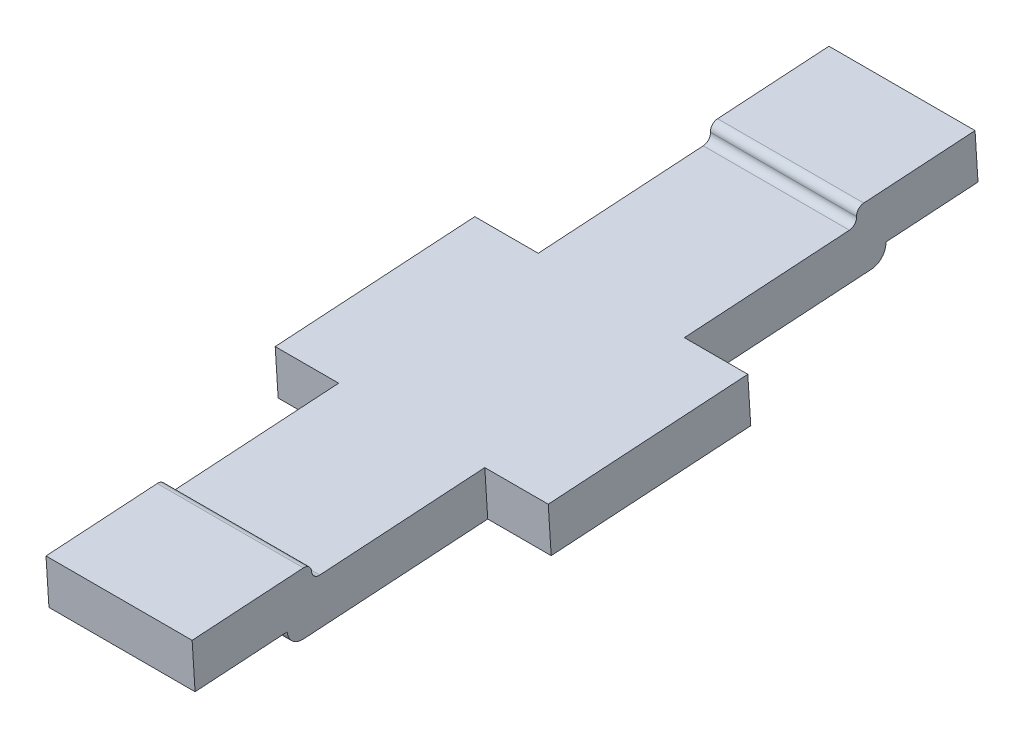
ISO-10303-21;
HEADER;
FILE_DESCRIPTION(('STEP AP214'),'2;1');
FILE_NAME('part.step','',(''),(''),'','','');
FILE_SCHEMA(('AUTOMOTIVE_DESIGN { 1 0 10303 214 1 1 1 1 }'));
ENDSEC;
DATA;
#1=APPLICATION_CONTEXT('core data for automotive mechanical design processes');
#2=APPLICATION_PROTOCOL_DEFINITION('international standard','automotive_design',2000,#1);
#3=PRODUCT_CONTEXT('',#1,'mechanical');
#4=PRODUCT('Part','Part','',(#3));
#5=PRODUCT_RELATED_PRODUCT_CATEGORY('part','',(#4));
#6=PRODUCT_DEFINITION_FORMATION('','',#4);
#7=PRODUCT_DEFINITION_CONTEXT('part definition',#1,'design');
#8=PRODUCT_DEFINITION('design','',#6,#7);
#9=PRODUCT_DEFINITION_SHAPE('','',#8);
#10=(LENGTH_UNIT() NAMED_UNIT(*) SI_UNIT(.MILLI.,.METRE.));
#11=(NAMED_UNIT(*) PLANE_ANGLE_UNIT() SI_UNIT($,.RADIAN.));
#12=(NAMED_UNIT(*) SI_UNIT($,.STERADIAN.) SOLID_ANGLE_UNIT());
#13=UNCERTAINTY_MEASURE_WITH_UNIT(LENGTH_MEASURE(1.E-05),#10,'distance_accuracy_value','');
#14=(GEOMETRIC_REPRESENTATION_CONTEXT(3) GLOBAL_UNCERTAINTY_ASSIGNED_CONTEXT((#13)) GLOBAL_UNIT_ASSIGNED_CONTEXT((#10,
#11,#12)) REPRESENTATION_CONTEXT('',''));
#15=CARTESIAN_POINT('',(0.,0.,0.));
#16=DIRECTION('',(0.,0.,1.));
#17=DIRECTION('',(1.,0.,0.));
#18=AXIS2_PLACEMENT_3D('',#15,#16,#17);
#19=CARTESIAN_POINT('',(-1.775,0.,0.));
#20=DIRECTION('',(1.,0.,0.));
#21=DIRECTION('',(0.,0.,-1.));
#22=AXIS2_PLACEMENT_3D('',#19,#20,#21);
#23=PLANE('',#22);
#24=DIRECTION('',(0.,0.997969082863627,0.0637001542253368));
#25=VECTOR('',#24,1.);
#26=CARTESIAN_POINT('',(-1.775,-0.707019964007326,1.25751663132818));
#27=LINE('',#26,#25);
#28=CARTESIAN_POINT('',(-1.775,-0.707019964007326,1.25751663132818));
#29=VERTEX_POINT('',#28);
#30=CARTESIAN_POINT('',(-1.775,-0.108238514289151,1.29573672386338));
#31=VERTEX_POINT('',#30);
#32=EDGE_CURVE('E11',#29,#31,#27,.T.);
#33=ORIENTED_EDGE('',*,*,#32,.T.);
#34=DIRECTION('',(0.,-0.0637001542253372,0.997969082863627));
#35=VECTOR('',#34,1.);
#36=CARTESIAN_POINT('',(-1.775,0.057381886696726,-1.29898289158205));
#37=LINE('',#36,#35);
#38=CARTESIAN_POINT('',(-1.775,0.057381886696726,-1.29898289158205));
#39=VERTEX_POINT('',#38);
#40=EDGE_CURVE('E42',#39,#31,#37,.T.);
#41=ORIENTED_EDGE('',*,*,#40,.F.);
#42=DIRECTION('',(0.,-0.997969082863627,-0.0637001542253365));
#43=VECTOR('',#42,1.);
#44=CARTESIAN_POINT('',(-1.775,0.057381886696726,-1.29898289158205));
#45=LINE('',#44,#43);
#46=CARTESIAN_POINT('',(-1.775,-0.54139956302145,-1.33720298411725));
#47=VERTEX_POINT('',#46);
#48=EDGE_CURVE('E28',#39,#47,#45,.T.);
#49=ORIENTED_EDGE('',*,*,#48,.T.);
#50=DIRECTION('',(0.,0.0637001542253371,-0.997969082863627));
#51=VECTOR('',#50,1.);
#52=CARTESIAN_POINT('',(-1.775,-0.707019964007326,1.25751663132818));
#53=LINE('',#52,#51);
#54=EDGE_CURVE('E262',#29,#47,#53,.T.);
#55=ORIENTED_EDGE('',*,*,#54,.F.);
#56=EDGE_LOOP('',(#33,#41,#49,#55));
#57=FACE_BOUND('',#56,.T.);
#58=ADVANCED_FACE('F17',(#57),#23,.F.);
#59=CARTESIAN_POINT('',(1.775,0.,0.));
#60=DIRECTION('',(1.,0.,0.));
#61=DIRECTION('',(0.,0.,-1.));
#62=AXIS2_PLACEMENT_3D('',#59,#60,#61);
#63=PLANE('',#62);
#64=DIRECTION('',(0.,-0.997969082863627,-0.0637001542253372));
#65=VECTOR('',#64,1.);
#66=CARTESIAN_POINT('',(1.775,-0.707019964007326,1.25751663132818));
#67=LINE('',#66,#65);
#68=CARTESIAN_POINT('',(1.775,-0.108238514289151,1.29573672386338));
#69=VERTEX_POINT('',#68);
#70=CARTESIAN_POINT('',(1.775,-0.707019964007326,1.25751663132818));
#71=VERTEX_POINT('',#70);
#72=EDGE_CURVE('E305',#69,#71,#67,.T.);
#73=ORIENTED_EDGE('',*,*,#72,.T.);
#74=DIRECTION('',(0.,0.0637001542253371,-0.997969082863627));
#75=VECTOR('',#74,1.);
#76=CARTESIAN_POINT('',(1.775,-0.707019964007326,1.25751663132818));
#77=LINE('',#76,#75);
#78=CARTESIAN_POINT('',(1.775,-0.54139956302145,-1.33720298411725));
#79=VERTEX_POINT('',#78);
#80=EDGE_CURVE('E309',#71,#79,#77,.T.);
#81=ORIENTED_EDGE('',*,*,#80,.T.);
#82=DIRECTION('',(0.,0.997969082863627,0.0637001542253368));
#83=VECTOR('',#82,1.);
#84=CARTESIAN_POINT('',(1.775,0.0573818866967259,-1.29898289158205));
#85=LINE('',#84,#83);
#86=CARTESIAN_POINT('',(1.775,0.0573818866967259,-1.29898289158205));
#87=VERTEX_POINT('',#86);
#88=EDGE_CURVE('E364',#79,#87,#85,.T.);
#89=ORIENTED_EDGE('',*,*,#88,.T.);
#90=DIRECTION('',(0.,-0.0637001542253372,0.997969082863627));
#91=VECTOR('',#90,1.);
#92=CARTESIAN_POINT('',(1.775,0.0573818866967259,-1.29898289158205));
#93=LINE('',#92,#91);
#94=EDGE_CURVE('E318',#87,#69,#93,.T.);
#95=ORIENTED_EDGE('',*,*,#94,.T.);
#96=EDGE_LOOP('',(#73,#81,#89,#95));
#97=FACE_BOUND('',#96,.T.);
#98=ADVANCED_FACE('F501',(#97),#63,.T.);
#99=CARTESIAN_POINT('',(-1.775,-0.749486733490884,5.06253917705503));
#100=DIRECTION('',(0.,-0.997969082863627,-0.0637001542253375));
#101=DIRECTION('',(0.,0.0637001542253375,-0.997969082863627));
#102=AXIS2_PLACEMENT_3D('',#99,#100,#101);
#103=PLANE('',#102);
#104=DIRECTION('',(0.,-0.0637001542253376,0.997969082863627));
#105=VECTOR('',#104,1.);
#106=CARTESIAN_POINT('',(0.95,-0.749486733490884,5.06253917705503));
#107=LINE('',#106,#105);
#108=CARTESIAN_POINT('',(0.95,-0.673046548420478,3.86497627761868));
#109=VERTEX_POINT('',#108);
#110=CARTESIAN_POINT('',(0.95,-0.749486733490884,5.06253917705503));
#111=VERTEX_POINT('',#110);
#112=EDGE_CURVE('E314',#109,#111,#107,.T.);
#113=ORIENTED_EDGE('',*,*,#112,.T.);
#114=DIRECTION('',(1.,0.,0.));
#115=VECTOR('',#114,1.);
#116=CARTESIAN_POINT('',(-0.95,-0.749486733490884,5.06253917705503));
#117=LINE('',#116,#115);
#118=CARTESIAN_POINT('',(-0.95,-0.749486733490884,5.06253917705503));
#119=VERTEX_POINT('',#118);
#120=EDGE_CURVE('E320',#119,#111,#117,.T.);
#121=ORIENTED_EDGE('',*,*,#120,.F.);
#122=DIRECTION('',(0.,0.0637001542253376,-0.997969082863627));
#123=VECTOR('',#122,1.);
#124=CARTESIAN_POINT('',(-0.95,-0.673046548420479,3.86497627761868));
#125=LINE('',#124,#123);
#126=CARTESIAN_POINT('',(-0.95,-0.673046548420478,3.86497627761868));
#127=VERTEX_POINT('',#126);
#128=EDGE_CURVE('E319',#119,#127,#125,.T.);
#129=ORIENTED_EDGE('',*,*,#128,.T.);
#130=DIRECTION('',(1.,0.,0.));
#131=VECTOR('',#130,1.);
#132=CARTESIAN_POINT('',(-0.95,-0.673046548420479,3.86497627761868));
#133=LINE('',#132,#131);
#134=EDGE_CURVE('E356',#127,#109,#133,.T.);
#135=ORIENTED_EDGE('',*,*,#134,.T.);
#136=EDGE_LOOP('',(#113,#121,#129,#135));
#137=FACE_BOUND('',#136,.T.);
#138=ADVANCED_FACE('F518',(#137),#103,.T.);
#139=CARTESIAN_POINT('',(-1.775,-0.150705283772707,5.10075926959023));
#140=DIRECTION('',(0.,-0.0637001542253374,0.997969082863627));
#141=DIRECTION('',(-1.,0.,0.));
#142=AXIS2_PLACEMENT_3D('',#139,#140,#141);
#143=PLANE('',#142);
#144=DIRECTION('',(0.,0.997969082863627,0.0637001542253374));
#145=VECTOR('',#144,1.);
#146=CARTESIAN_POINT('',(0.95,-0.150705283772707,5.10075926959023));
#147=LINE('',#146,#145);
#148=CARTESIAN_POINT('',(0.95,-0.150705283772707,5.10075926959023));
#149=VERTEX_POINT('',#148);
#150=EDGE_CURVE('E386',#111,#149,#147,.T.);
#151=ORIENTED_EDGE('',*,*,#150,.T.);
#152=DIRECTION('',(1.,0.,0.));
#153=VECTOR('',#152,1.);
#154=CARTESIAN_POINT('',(-0.95,-0.150705283772707,5.10075926959023));
#155=LINE('',#154,#153);
#156=CARTESIAN_POINT('',(-0.95,-0.150705283772707,5.10075926959023));
#157=VERTEX_POINT('',#156);
#158=EDGE_CURVE('E203',#157,#149,#155,.T.);
#159=ORIENTED_EDGE('',*,*,#158,.F.);
#160=DIRECTION('',(0.,-0.997969082863627,-0.0637001542253374));
#161=VECTOR('',#160,1.);
#162=CARTESIAN_POINT('',(-0.95,-0.749486733490884,5.06253917705503));
#163=LINE('',#162,#161);
#164=EDGE_CURVE('E323',#157,#119,#163,.T.);
#165=ORIENTED_EDGE('',*,*,#164,.T.);
#166=ORIENTED_EDGE('',*,*,#120,.T.);
#167=EDGE_LOOP('',(#151,#159,#165,#166));
#168=FACE_BOUND('',#167,.T.);
#169=ADVANCED_FACE('F516',(#168),#143,.T.);
#170=CARTESIAN_POINT('',(-1.775,-0.0583400601459682,3.65370409943797));
#171=DIRECTION('',(0.,0.997969082863627,0.0637001542253369));
#172=DIRECTION('',(1.,0.,0.));
#173=AXIS2_PLACEMENT_3D('',#170,#171,#172);
#174=PLANE('',#173);
#175=DIRECTION('',(0.,0.0637001542253369,-0.997969082863627));
#176=VECTOR('',#175,1.);
#177=CARTESIAN_POINT('',(0.95,-0.0583400601459682,3.65370409943797));
#178=LINE('',#177,#176);
#179=CARTESIAN_POINT('',(0.95,-0.0583400601459681,3.65370409943797));
#180=VERTEX_POINT('',#179);
#181=EDGE_CURVE('E324',#149,#180,#178,.T.);
#182=ORIENTED_EDGE('',*,*,#181,.T.);
#183=DIRECTION('',(1.,0.,0.));
#184=VECTOR('',#183,1.);
#185=CARTESIAN_POINT('',(-0.95,-0.0583400601459682,3.65370409943797));
#186=LINE('',#185,#184);
#187=CARTESIAN_POINT('',(-0.95,-0.0583400601459681,3.65370409943797));
#188=VERTEX_POINT('',#187);
#189=EDGE_CURVE('E219',#188,#180,#186,.T.);
#190=ORIENTED_EDGE('',*,*,#189,.F.);
#191=DIRECTION('',(0.,-0.0637001542253369,0.997969082863627));
#192=VECTOR('',#191,1.);
#193=CARTESIAN_POINT('',(-0.95,-0.150705283772707,5.10075926959023));
#194=LINE('',#193,#192);
#195=EDGE_CURVE('E337',#188,#157,#194,.T.);
#196=ORIENTED_EDGE('',*,*,#195,.T.);
#197=ORIENTED_EDGE('',*,*,#158,.T.);
#198=EDGE_LOOP('',(#182,#190,#196,#197));
#199=FACE_BOUND('',#198,.T.);
#200=ADVANCED_FACE('F521',(#199),#174,.T.);
#201=CARTESIAN_POINT('',(-1.775,-0.158136968432331,3.64733408401544));
#202=DIRECTION('',(1.,0.,0.));
#203=DIRECTION('',(0.,0.0637001542253356,-0.997969082863627));
#204=AXIS2_PLACEMENT_3D('',#201,#202,#203);
#205=CYLINDRICAL_SURFACE('',#204,0.1);
#206=CARTESIAN_POINT('',(0.95,-0.158136968432331,3.64733408401544));
#207=DIRECTION('',(-1.,0.,0.));
#208=DIRECTION('',(0.,0.0637001542253355,-0.997969082863627));
#209=AXIS2_PLACEMENT_3D('',#206,#207,#208);
#210=CIRCLE('',#209,0.1);
#211=CARTESIAN_POINT('',(0.95,-0.151766953009797,3.54753717572908));
#212=VERTEX_POINT('',#211);
#213=EDGE_CURVE('E338',#180,#212,#210,.T.);
#214=ORIENTED_EDGE('',*,*,#213,.T.);
#215=DIRECTION('',(1.,0.,0.));
#216=VECTOR('',#215,1.);
#217=CARTESIAN_POINT('',(-0.95,-0.151766953009797,3.54753717572908));
#218=LINE('',#217,#216);
#219=CARTESIAN_POINT('',(-0.95,-0.151766953009797,3.54753717572908));
#220=VERTEX_POINT('',#219);
#221=EDGE_CURVE('E399',#220,#212,#218,.T.);
#222=ORIENTED_EDGE('',*,*,#221,.F.);
#223=CARTESIAN_POINT('',(-0.95,-0.158136968432331,3.64733408401544));
#224=DIRECTION('',(1.,0.,0.));
#225=DIRECTION('',(0.,0.0637001542253355,-0.997969082863627));
#226=AXIS2_PLACEMENT_3D('',#223,#224,#225);
#227=CIRCLE('',#226,0.1);
#228=EDGE_CURVE('E390',#220,#188,#227,.T.);
#229=ORIENTED_EDGE('',*,*,#228,.T.);
#230=ORIENTED_EDGE('',*,*,#189,.T.);
#231=EDGE_LOOP('',(#214,#222,#229,#230));
#232=FACE_BOUND('',#231,.T.);
#233=ADVANCED_FACE('F523',(#232),#205,.T.);
#234=CARTESIAN_POINT('',(-1.775,-0.145396937587263,3.44774026744271));
#235=DIRECTION('',(-1.,0.,0.));
#236=DIRECTION('',(0.,-0.997969082863627,-0.0637001542253391));
#237=AXIS2_PLACEMENT_3D('',#234,#235,#236);
#238=CYLINDRICAL_SURFACE('',#237,0.1);
#239=CARTESIAN_POINT('',(0.95,-0.145396937587263,3.44774026744271));
#240=DIRECTION('',(1.,0.,0.));
#241=DIRECTION('',(0.,-0.997969082863627,-0.063700154225339));
#242=AXIS2_PLACEMENT_3D('',#239,#240,#241);
#243=CIRCLE('',#242,0.1);
#244=CARTESIAN_POINT('',(0.95,-0.245193845873626,3.44137025202018));
#245=VERTEX_POINT('',#244);
#246=EDGE_CURVE('E300',#212,#245,#243,.T.);
#247=ORIENTED_EDGE('',*,*,#246,.T.);
#248=DIRECTION('',(1.,0.,0.));
#249=VECTOR('',#248,1.);
#250=CARTESIAN_POINT('',(-0.95,-0.245193845873626,3.44137025202018));
#251=LINE('',#250,#249);
#252=CARTESIAN_POINT('',(-0.95,-0.245193845873626,3.44137025202018));
#253=VERTEX_POINT('',#252);
#254=EDGE_CURVE('E325',#253,#245,#251,.T.);
#255=ORIENTED_EDGE('',*,*,#254,.F.);
#256=CARTESIAN_POINT('',(-0.95,-0.145396937587263,3.44774026744271));
#257=DIRECTION('',(-1.,0.,0.));
#258=DIRECTION('',(0.,-0.997969082863627,-0.063700154225339));
#259=AXIS2_PLACEMENT_3D('',#256,#257,#258);
#260=CIRCLE('',#259,0.1);
#261=EDGE_CURVE('E402',#253,#220,#260,.T.);
#262=ORIENTED_EDGE('',*,*,#261,.T.);
#263=ORIENTED_EDGE('',*,*,#221,.T.);
#264=EDGE_LOOP('',(#247,#255,#262,#263));
#265=FACE_BOUND('',#264,.T.);
#266=ADVANCED_FACE('F526',(#265),#238,.F.);
#267=CARTESIAN_POINT('',(-1.775,0.194337218281201,-3.44461641973884));
#268=DIRECTION('',(0.,0.997969082863627,0.0637001542253372));
#269=DIRECTION('',(1.,0.,0.));
#270=AXIS2_PLACEMENT_3D('',#267,#268,#269);
#271=PLANE('',#270);
#272=DIRECTION('',(1.,0.,0.));
#273=VECTOR('',#272,1.);
#274=CARTESIAN_POINT('',(1.775,-0.108238514289151,1.29573672386338));
#275=LINE('',#274,#273);
#276=CARTESIAN_POINT('',(0.95,-0.108238514289151,1.29573672386338));
#277=VERTEX_POINT('',#276);
#278=EDGE_CURVE('E379',#277,#69,#275,.T.);
#279=ORIENTED_EDGE('',*,*,#278,.T.);
#280=ORIENTED_EDGE('',*,*,#94,.F.);
#281=DIRECTION('',(-1.,0.,0.));
#282=VECTOR('',#281,1.);
#283=CARTESIAN_POINT('',(0.95,0.0573818866967259,-1.29898289158205));
#284=LINE('',#283,#282);
#285=CARTESIAN_POINT('',(0.95,0.0573818866967253,-1.29898289158205));
#286=VERTEX_POINT('',#285);
#287=EDGE_CURVE('E370',#87,#286,#284,.T.);
#288=ORIENTED_EDGE('',*,*,#287,.T.);
#289=DIRECTION('',(0.,0.0637001542253372,-0.997969082863627));
#290=VECTOR('',#289,1.);
#291=CARTESIAN_POINT('',(0.95,0.194337218281201,-3.44461641973884));
#292=LINE('',#291,#290);
#293=CARTESIAN_POINT('',(0.95,0.194337218281201,-3.44461641973884));
#294=VERTEX_POINT('',#293);
#295=EDGE_CURVE('E59',#286,#294,#292,.T.);
#296=ORIENTED_EDGE('',*,*,#295,.T.);
#297=DIRECTION('',(1.,0.,0.));
#298=VECTOR('',#297,1.);
#299=CARTESIAN_POINT('',(-0.95,0.194337218281201,-3.44461641973884));
#300=LINE('',#299,#298);
#301=CARTESIAN_POINT('',(-0.95,0.194337218281201,-3.44461641973884));
#302=VERTEX_POINT('',#301);
#303=EDGE_CURVE('E75',#302,#294,#300,.T.);
#304=ORIENTED_EDGE('',*,*,#303,.F.);
#305=DIRECTION('',(0.,-0.0637001542253372,0.997969082863627));
#306=VECTOR('',#305,1.);
#307=CARTESIAN_POINT('',(-0.95,0.0573818866967259,-1.29898289158205));
#308=LINE('',#307,#306);
#309=CARTESIAN_POINT('',(-0.95,0.0573818866967262,-1.29898289158205));
#310=VERTEX_POINT('',#309);
#311=EDGE_CURVE('E371',#302,#310,#308,.T.);
#312=ORIENTED_EDGE('',*,*,#311,.T.);
#313=DIRECTION('',(-1.,0.,0.));
#314=VECTOR('',#313,1.);
#315=CARTESIAN_POINT('',(-1.775,0.057381886696726,-1.29898289158205));
#316=LINE('',#315,#314);
#317=EDGE_CURVE('E395',#310,#39,#316,.T.);
#318=ORIENTED_EDGE('',*,*,#317,.T.);
#319=ORIENTED_EDGE('',*,*,#40,.T.);
#320=DIRECTION('',(1.,0.,0.));
#321=VECTOR('',#320,1.);
#322=CARTESIAN_POINT('',(-0.95,-0.108238514289151,1.29573672386338));
#323=LINE('',#322,#321);
#324=CARTESIAN_POINT('',(-0.95,-0.108238514289151,1.29573672386338));
#325=VERTEX_POINT('',#324);
#326=EDGE_CURVE('E343',#31,#325,#323,.T.);
#327=ORIENTED_EDGE('',*,*,#326,.T.);
#328=DIRECTION('',(0.,-0.0637001542253371,0.997969082863627));
#329=VECTOR('',#328,1.);
#330=CARTESIAN_POINT('',(-0.95,-0.245193845873626,3.44137025202018));
#331=LINE('',#330,#329);
#332=EDGE_CURVE('E278',#325,#253,#331,.T.);
#333=ORIENTED_EDGE('',*,*,#332,.T.);
#334=ORIENTED_EDGE('',*,*,#254,.T.);
#335=DIRECTION('',(0.,0.0637001542253371,-0.997969082863627));
#336=VECTOR('',#335,1.);
#337=CARTESIAN_POINT('',(0.95,-0.108238514289151,1.29573672386338));
#338=LINE('',#337,#336);
#339=EDGE_CURVE('E328',#245,#277,#338,.T.);
#340=ORIENTED_EDGE('',*,*,#339,.T.);
#341=EDGE_LOOP('',(#279,#280,#288,#296,#304,#312,#318,#319,#327,#333,#334,#340));
#342=FACE_BOUND('',#341,.T.);
#343=ADVANCED_FACE('F527',(#342),#271,.T.);
#344=CARTESIAN_POINT('',(-1.775,0.294134126567563,-3.43824640431631));
#345=DIRECTION('',(-1.,0.,0.));
#346=DIRECTION('',(0.,0.0637001542253392,-0.997969082863627));
#347=AXIS2_PLACEMENT_3D('',#344,#345,#346);
#348=CYLINDRICAL_SURFACE('',#347,0.1);
#349=CARTESIAN_POINT('',(0.95,0.294134126567564,-3.43824640431631));
#350=DIRECTION('',(1.,0.,0.));
#351=DIRECTION('',(0.,0.0637001542253391,-0.997969082863627));
#352=AXIS2_PLACEMENT_3D('',#349,#350,#351);
#353=CIRCLE('',#352,0.1);
#354=CARTESIAN_POINT('',(0.95,0.300504141990097,-3.53804331260267));
#355=VERTEX_POINT('',#354);
#356=EDGE_CURVE('E313',#294,#355,#353,.T.);
#357=ORIENTED_EDGE('',*,*,#356,.T.);
#358=DIRECTION('',(1.,0.,0.));
#359=VECTOR('',#358,1.);
#360=CARTESIAN_POINT('',(-0.95,0.300504141990097,-3.53804331260267));
#361=LINE('',#360,#359);
#362=CARTESIAN_POINT('',(-0.95,0.300504141990097,-3.53804331260267));
#363=VERTEX_POINT('',#362);
#364=EDGE_CURVE('E301',#363,#355,#361,.T.);
#365=ORIENTED_EDGE('',*,*,#364,.F.);
#366=CARTESIAN_POINT('',(-0.95,0.294134126567564,-3.43824640431631));
#367=DIRECTION('',(-1.,0.,0.));
#368=DIRECTION('',(0.,0.0637001542253391,-0.997969082863627));
#369=AXIS2_PLACEMENT_3D('',#366,#367,#368);
#370=CIRCLE('',#369,0.1);
#371=EDGE_CURVE('E310',#363,#302,#370,.T.);
#372=ORIENTED_EDGE('',*,*,#371,.T.);
#373=ORIENTED_EDGE('',*,*,#303,.T.);
#374=EDGE_LOOP('',(#357,#365,#372,#373));
#375=FACE_BOUND('',#374,.T.);
#376=ADVANCED_FACE('F535',(#375),#348,.F.);
#377=CARTESIAN_POINT('',(-1.775,0.306874157412631,-3.63784022088904));
#378=DIRECTION('',(1.,0.,0.));
#379=DIRECTION('',(0.,0.997969082863627,0.0637001542253391));
#380=AXIS2_PLACEMENT_3D('',#377,#378,#379);
#381=CYLINDRICAL_SURFACE('',#380,0.1);
#382=CARTESIAN_POINT('',(0.95,0.306874157412631,-3.63784022088904));
#383=DIRECTION('',(-1.,0.,0.));
#384=DIRECTION('',(0.,0.997969082863627,0.063700154225339));
#385=AXIS2_PLACEMENT_3D('',#382,#383,#384);
#386=CIRCLE('',#385,0.1);
#387=CARTESIAN_POINT('',(0.95,0.406671065698993,-3.6314702054665));
#388=VERTEX_POINT('',#387);
#389=EDGE_CURVE('E376',#355,#388,#386,.T.);
#390=ORIENTED_EDGE('',*,*,#389,.T.);
#391=DIRECTION('',(1.,0.,0.));
#392=VECTOR('',#391,1.);
#393=CARTESIAN_POINT('',(-0.95,0.406671065698993,-3.6314702054665));
#394=LINE('',#393,#392);
#395=CARTESIAN_POINT('',(-0.95,0.406671065698993,-3.6314702054665));
#396=VERTEX_POINT('',#395);
#397=EDGE_CURVE('E431',#396,#388,#394,.T.);
#398=ORIENTED_EDGE('',*,*,#397,.F.);
#399=CARTESIAN_POINT('',(-0.95,0.306874157412631,-3.63784022088904));
#400=DIRECTION('',(1.,0.,0.));
#401=DIRECTION('',(0.,0.997969082863627,0.063700154225339));
#402=AXIS2_PLACEMENT_3D('',#399,#400,#401);
#403=CIRCLE('',#402,0.1);
#404=EDGE_CURVE('E303',#396,#363,#403,.T.);
#405=ORIENTED_EDGE('',*,*,#404,.T.);
#406=ORIENTED_EDGE('',*,*,#364,.T.);
#407=EDGE_LOOP('',(#390,#398,#405,#406));
#408=FACE_BOUND('',#407,.T.);
#409=ADVANCED_FACE('F537',(#408),#381,.T.);
#410=CARTESIAN_POINT('',(-1.775,0.499036289325733,-5.07852537561876));
#411=DIRECTION('',(0.,0.997969082863627,0.0637001542253375));
#412=DIRECTION('',(1.,0.,0.));
#413=AXIS2_PLACEMENT_3D('',#410,#411,#412);
#414=PLANE('',#413);
#415=DIRECTION('',(0.,0.0637001542253375,-0.997969082863627));
#416=VECTOR('',#415,1.);
#417=CARTESIAN_POINT('',(0.95,0.499036289325733,-5.07852537561876));
#418=LINE('',#417,#416);
#419=CARTESIAN_POINT('',(0.95,0.499036289325733,-5.07852537561876));
#420=VERTEX_POINT('',#419);
#421=EDGE_CURVE('E304',#388,#420,#418,.T.);
#422=ORIENTED_EDGE('',*,*,#421,.T.);
#423=DIRECTION('',(1.,0.,0.));
#424=VECTOR('',#423,1.);
#425=CARTESIAN_POINT('',(-0.95,0.499036289325733,-5.07852537561876));
#426=LINE('',#425,#424);
#427=CARTESIAN_POINT('',(-0.95,0.499036289325733,-5.07852537561876));
#428=VERTEX_POINT('',#427);
#429=EDGE_CURVE('E334',#428,#420,#426,.T.);
#430=ORIENTED_EDGE('',*,*,#429,.F.);
#431=DIRECTION('',(0.,-0.0637001542253375,0.997969082863627));
#432=VECTOR('',#431,1.);
#433=CARTESIAN_POINT('',(-0.95,0.406671065698993,-3.6314702054665));
#434=LINE('',#433,#432);
#435=EDGE_CURVE('E419',#428,#396,#434,.T.);
#436=ORIENTED_EDGE('',*,*,#435,.T.);
#437=ORIENTED_EDGE('',*,*,#397,.T.);
#438=EDGE_LOOP('',(#422,#430,#436,#437));
#439=FACE_BOUND('',#438,.T.);
#440=ADVANCED_FACE('F483',(#439),#414,.T.);
#441=CARTESIAN_POINT('',(-1.775,-0.099745160392445,-5.11674546815396));
#442=DIRECTION('',(0.,0.0637001542253403,-0.997969082863627));
#443=DIRECTION('',(-1.,0.,0.));
#444=AXIS2_PLACEMENT_3D('',#441,#442,#443);
#445=PLANE('',#444);
#446=DIRECTION('',(0.,-0.997969082863627,-0.0637001542253406));
#447=VECTOR('',#446,1.);
#448=CARTESIAN_POINT('',(0.95,-0.099745160392445,-5.11674546815396));
#449=LINE('',#448,#447);
#450=CARTESIAN_POINT('',(0.95,-0.099745160392445,-5.11674546815397));
#451=VERTEX_POINT('',#450);
#452=EDGE_CURVE('E333',#420,#451,#449,.T.);
#453=ORIENTED_EDGE('',*,*,#452,.T.);
#454=DIRECTION('',(1.,0.,0.));
#455=VECTOR('',#454,1.);
#456=CARTESIAN_POINT('',(-0.95,-0.099745160392445,-5.11674546815396));
#457=LINE('',#456,#455);
#458=CARTESIAN_POINT('',(-0.95,-0.099745160392445,-5.11674546815396));
#459=VERTEX_POINT('',#458);
#460=EDGE_CURVE('E398',#459,#451,#457,.T.);
#461=ORIENTED_EDGE('',*,*,#460,.F.);
#462=DIRECTION('',(0.,0.997969082863627,0.0637001542253407));
#463=VECTOR('',#462,1.);
#464=CARTESIAN_POINT('',(-0.95,0.499036289325729,-5.07852537561876));
#465=LINE('',#464,#463);
#466=EDGE_CURVE('E329',#459,#428,#465,.T.);
#467=ORIENTED_EDGE('',*,*,#466,.T.);
#468=ORIENTED_EDGE('',*,*,#429,.T.);
#469=EDGE_LOOP('',(#453,#461,#467,#468));
#470=FACE_BOUND('',#469,.T.);
#471=ADVANCED_FACE('F19',(#470),#445,.T.);
#472=CARTESIAN_POINT('',(-1.775,-0.176185345462849,-3.91918256871761));
#473=DIRECTION('',(0.,-0.997969082863627,-0.063700154225337));
#474=DIRECTION('',(0.,0.063700154225337,-0.997969082863627));
#475=AXIS2_PLACEMENT_3D('',#472,#473,#474);
#476=PLANE('',#475);
#477=DIRECTION('',(0.,-0.0637001542253369,0.997969082863627));
#478=VECTOR('',#477,1.);
#479=CARTESIAN_POINT('',(0.95,-0.176185345462849,-3.91918256871761));
#480=LINE('',#479,#478);
#481=CARTESIAN_POINT('',(0.95,-0.176185345462849,-3.91918256871761));
#482=VERTEX_POINT('',#481);
#483=EDGE_CURVE('E441',#451,#482,#480,.T.);
#484=ORIENTED_EDGE('',*,*,#483,.T.);
#485=DIRECTION('',(1.,0.,0.));
#486=VECTOR('',#485,1.);
#487=CARTESIAN_POINT('',(-0.95,-0.176185345462849,-3.91918256871761));
#488=LINE('',#487,#486);
#489=CARTESIAN_POINT('',(-0.95,-0.176185345462849,-3.91918256871761));
#490=VERTEX_POINT('',#489);
#491=EDGE_CURVE('E90',#490,#482,#488,.T.);
#492=ORIENTED_EDGE('',*,*,#491,.F.);
#493=DIRECTION('',(0.,0.063700154225337,-0.997969082863627));
#494=VECTOR('',#493,1.);
#495=CARTESIAN_POINT('',(-0.95,-0.099745160392445,-5.11674546815396));
#496=LINE('',#495,#494);
#497=EDGE_CURVE('E410',#490,#459,#496,.T.);
#498=ORIENTED_EDGE('',*,*,#497,.T.);
#499=ORIENTED_EDGE('',*,*,#460,.T.);
#500=EDGE_LOOP('',(#484,#492,#498,#499));
#501=FACE_BOUND('',#500,.T.);
#502=ADVANCED_FACE('F492',(#501),#476,.T.);
#503=CARTESIAN_POINT('',(-1.775,-0.188925376307915,-3.71958875214489));
#504=DIRECTION('',(1.,0.,0.));
#505=DIRECTION('',(0.,-0.997969082863627,-0.0637001542253369));
#506=AXIS2_PLACEMENT_3D('',#503,#504,#505);
#507=CYLINDRICAL_SURFACE('',#506,0.2);
#508=CARTESIAN_POINT('',(0.95,-0.188925376307915,-3.71958875214489));
#509=DIRECTION('',(-1.,0.,0.));
#510=DIRECTION('',(0.,-0.997969082863627,-0.0637001542253368));
#511=AXIS2_PLACEMENT_3D('',#508,#509,#510);
#512=CIRCLE('',#511,0.2);
#513=CARTESIAN_POINT('',(0.95,-0.388519192880641,-3.73232878298995));
#514=VERTEX_POINT('',#513);
#515=EDGE_CURVE('E352',#482,#514,#512,.T.);
#516=ORIENTED_EDGE('',*,*,#515,.T.);
#517=DIRECTION('',(1.,0.,0.));
#518=VECTOR('',#517,1.);
#519=CARTESIAN_POINT('',(-0.95,-0.388519192880641,-3.73232878298995));
#520=LINE('',#519,#518);
#521=CARTESIAN_POINT('',(-0.95,-0.388519192880641,-3.73232878298995));
#522=VERTEX_POINT('',#521);
#523=EDGE_CURVE('E102',#522,#514,#520,.T.);
#524=ORIENTED_EDGE('',*,*,#523,.F.);
#525=CARTESIAN_POINT('',(-0.95,-0.188925376307915,-3.71958875214489));
#526=DIRECTION('',(1.,0.,0.));
#527=DIRECTION('',(0.,-0.997969082863627,-0.0637001542253368));
#528=AXIS2_PLACEMENT_3D('',#525,#526,#527);
#529=CIRCLE('',#528,0.2);
#530=EDGE_CURVE('E348',#522,#490,#529,.T.);
#531=ORIENTED_EDGE('',*,*,#530,.T.);
#532=ORIENTED_EDGE('',*,*,#491,.T.);
#533=EDGE_LOOP('',(#516,#524,#531,#532));
#534=FACE_BOUND('',#533,.T.);
#535=ADVANCED_FACE('F494',(#534),#507,.T.);
#536=CARTESIAN_POINT('',(-1.775,-0.859900334148136,3.65264243020089));
#537=DIRECTION('',(0.,-0.997969082863627,-0.0637001542253371));
#538=DIRECTION('',(0.,0.0637001542253371,-0.997969082863627));
#539=AXIS2_PLACEMENT_3D('',#536,#537,#538);
#540=PLANE('',#539);
#541=DIRECTION('',(-1.,0.,0.));
#542=VECTOR('',#541,1.);
#543=CARTESIAN_POINT('',(0.95,-0.707019964007326,1.25751663132818));
#544=LINE('',#543,#542);
#545=CARTESIAN_POINT('',(0.95,-0.707019964007326,1.25751663132818));
#546=VERTEX_POINT('',#545);
#547=EDGE_CURVE('E349',#71,#546,#544,.T.);
#548=ORIENTED_EDGE('',*,*,#547,.T.);
#549=DIRECTION('',(0.,-0.0637001542253372,0.997969082863627));
#550=VECTOR('',#549,1.);
#551=CARTESIAN_POINT('',(0.95,-0.859900334148136,3.65264243020089));
#552=LINE('',#551,#550);
#553=CARTESIAN_POINT('',(0.95,-0.859900334148136,3.65264243020089));
#554=VERTEX_POINT('',#553);
#555=EDGE_CURVE('E273',#546,#554,#552,.T.);
#556=ORIENTED_EDGE('',*,*,#555,.T.);
#557=DIRECTION('',(1.,0.,0.));
#558=VECTOR('',#557,1.);
#559=CARTESIAN_POINT('',(-0.95,-0.859900334148136,3.65264243020089));
#560=LINE('',#559,#558);
#561=CARTESIAN_POINT('',(-0.95,-0.859900334148136,3.65264243020089));
#562=VERTEX_POINT('',#561);
#563=EDGE_CURVE('E268',#562,#554,#560,.T.);
#564=ORIENTED_EDGE('',*,*,#563,.F.);
#565=DIRECTION('',(0.,0.0637001542253371,-0.997969082863627));
#566=VECTOR('',#565,1.);
#567=CARTESIAN_POINT('',(-0.95,-0.707019964007326,1.25751663132818));
#568=LINE('',#567,#566);
#569=CARTESIAN_POINT('',(-0.95,-0.707019964007327,1.25751663132818));
#570=VERTEX_POINT('',#569);
#571=EDGE_CURVE('E261',#562,#570,#568,.T.);
#572=ORIENTED_EDGE('',*,*,#571,.T.);
#573=DIRECTION('',(-1.,0.,0.));
#574=VECTOR('',#573,1.);
#575=CARTESIAN_POINT('',(-1.775,-0.707019964007326,1.25751663132818));
#576=LINE('',#575,#574);
#577=EDGE_CURVE('E255',#570,#29,#576,.T.);
#578=ORIENTED_EDGE('',*,*,#577,.T.);
#579=ORIENTED_EDGE('',*,*,#54,.T.);
#580=DIRECTION('',(1.,0.,0.));
#581=VECTOR('',#580,1.);
#582=CARTESIAN_POINT('',(-0.95,-0.54139956302145,-1.33720298411725));
#583=LINE('',#582,#581);
#584=CARTESIAN_POINT('',(-0.95,-0.54139956302145,-1.33720298411725));
#585=VERTEX_POINT('',#584);
#586=EDGE_CURVE('E361',#47,#585,#583,.T.);
#587=ORIENTED_EDGE('',*,*,#586,.T.);
#588=DIRECTION('',(0.,0.0637001542253372,-0.997969082863627));
#589=VECTOR('',#588,1.);
#590=CARTESIAN_POINT('',(-0.95,-0.388519192880641,-3.73232878298995));
#591=LINE('',#590,#589);
#592=EDGE_CURVE('E341',#585,#522,#591,.T.);
#593=ORIENTED_EDGE('',*,*,#592,.T.);
#594=ORIENTED_EDGE('',*,*,#523,.T.);
#595=DIRECTION('',(0.,-0.0637001542253371,0.997969082863627));
#596=VECTOR('',#595,1.);
#597=CARTESIAN_POINT('',(0.95,-0.54139956302145,-1.33720298411725));
#598=LINE('',#597,#596);
#599=CARTESIAN_POINT('',(0.95,-0.54139956302145,-1.33720298411725));
#600=VERTEX_POINT('',#599);
#601=EDGE_CURVE('E342',#514,#600,#598,.T.);
#602=ORIENTED_EDGE('',*,*,#601,.T.);
#603=DIRECTION('',(1.,0.,0.));
#604=VECTOR('',#603,1.);
#605=CARTESIAN_POINT('',(1.775,-0.54139956302145,-1.33720298411725));
#606=LINE('',#605,#604);
#607=EDGE_CURVE('E413',#600,#79,#606,.T.);
#608=ORIENTED_EDGE('',*,*,#607,.T.);
#609=ORIENTED_EDGE('',*,*,#80,.F.);
#610=EDGE_LOOP('',(#548,#556,#564,#572,#578,#579,#587,#593,#594,#602,#608,#609));
#611=FACE_BOUND('',#610,.T.);
#612=ADVANCED_FACE('F266',(#611),#540,.T.);
#613=CARTESIAN_POINT('',(-1.775,-0.66030651757541,3.66538246104595));
#614=DIRECTION('',(1.,0.,0.));
#615=DIRECTION('',(0.,-0.0637001542253351,0.997969082863627));
#616=AXIS2_PLACEMENT_3D('',#613,#614,#615);
#617=CYLINDRICAL_SURFACE('',#616,0.2);
#618=CARTESIAN_POINT('',(0.95,-0.66030651757541,3.66538246104595));
#619=DIRECTION('',(-1.,0.,0.));
#620=DIRECTION('',(0.,-0.0637001542253352,0.997969082863627));
#621=AXIS2_PLACEMENT_3D('',#618,#619,#620);
#622=CIRCLE('',#621,0.2);
#623=EDGE_CURVE('E420',#554,#109,#622,.T.);
#624=ORIENTED_EDGE('',*,*,#623,.T.);
#625=ORIENTED_EDGE('',*,*,#134,.F.);
#626=CARTESIAN_POINT('',(-0.95,-0.66030651757541,3.66538246104595));
#627=DIRECTION('',(1.,0.,0.));
#628=DIRECTION('',(0.,-0.0637001542253351,0.997969082863627));
#629=AXIS2_PLACEMENT_3D('',#626,#627,#628);
#630=CIRCLE('',#629,0.2);
#631=EDGE_CURVE('E424',#127,#562,#630,.T.);
#632=ORIENTED_EDGE('',*,*,#631,.T.);
#633=ORIENTED_EDGE('',*,*,#563,.T.);
#634=EDGE_LOOP('',(#624,#625,#632,#633));
#635=FACE_BOUND('',#634,.T.);
#636=ADVANCED_FACE('F512',(#635),#617,.T.);
#637=CARTESIAN_POINT('',(-0.95,-2.09725004933813,-1.43651258962682));
#638=DIRECTION('',(1.,0.,0.));
#639=DIRECTION('',(0.,0.,1.));
#640=AXIS2_PLACEMENT_3D('',#637,#638,#639);
#641=PLANE('',#640);
#642=ORIENTED_EDGE('',*,*,#592,.F.);
#643=DIRECTION('',(0.,0.997969082863627,0.0637001542253371));
#644=VECTOR('',#643,1.);
#645=CARTESIAN_POINT('',(-0.95,-0.54139956302145,-1.33720298411725));
#646=LINE('',#645,#644);
#647=EDGE_CURVE('E287',#585,#310,#646,.T.);
#648=ORIENTED_EDGE('',*,*,#647,.T.);
#649=ORIENTED_EDGE('',*,*,#311,.F.);
#650=ORIENTED_EDGE('',*,*,#371,.F.);
#651=ORIENTED_EDGE('',*,*,#404,.F.);
#652=ORIENTED_EDGE('',*,*,#435,.F.);
#653=ORIENTED_EDGE('',*,*,#466,.F.);
#654=ORIENTED_EDGE('',*,*,#497,.F.);
#655=ORIENTED_EDGE('',*,*,#530,.F.);
#656=EDGE_LOOP('',(#642,#648,#649,#650,#651,#652,#653,#654,#655));
#657=FACE_BOUND('',#656,.T.);
#658=ADVANCED_FACE('F487',(#657),#641,.F.);
#659=CARTESIAN_POINT('',(-1.775,-2.09725004933813,-1.43651258962682));
#660=DIRECTION('',(0.,-0.0637001542253368,0.997969082863627));
#661=DIRECTION('',(-1.,0.,0.));
#662=AXIS2_PLACEMENT_3D('',#659,#660,#661);
#663=PLANE('',#662);
#664=ORIENTED_EDGE('',*,*,#586,.F.);
#665=ORIENTED_EDGE('',*,*,#48,.F.);
#666=ORIENTED_EDGE('',*,*,#317,.F.);
#667=ORIENTED_EDGE('',*,*,#647,.F.);
#668=EDGE_LOOP('',(#664,#665,#666,#667));
#669=FACE_BOUND('',#668,.T.);
#670=ADVANCED_FACE('F571',(#669),#663,.F.);
#671=CARTESIAN_POINT('',(0.95,-2.09725004933813,-1.43651258962682));
#672=DIRECTION('',(0.,-0.063700154225337,0.997969082863627));
#673=DIRECTION('',(-1.,0.,0.));
#674=AXIS2_PLACEMENT_3D('',#671,#672,#673);
#675=PLANE('',#674);
#676=ORIENTED_EDGE('',*,*,#607,.F.);
#677=DIRECTION('',(0.,0.997969082863627,0.0637001542253369));
#678=VECTOR('',#677,1.);
#679=CARTESIAN_POINT('',(0.95,-0.54139956302145,-1.33720298411725));
#680=LINE('',#679,#678);
#681=EDGE_CURVE('E280',#600,#286,#680,.T.);
#682=ORIENTED_EDGE('',*,*,#681,.T.);
#683=ORIENTED_EDGE('',*,*,#287,.F.);
#684=ORIENTED_EDGE('',*,*,#88,.F.);
#685=EDGE_LOOP('',(#676,#682,#683,#684));
#686=FACE_BOUND('',#685,.T.);
#687=ADVANCED_FACE('F498',(#686),#675,.F.);
#688=CARTESIAN_POINT('',(0.95,-1.85518946328185,-5.2287951045086));
#689=DIRECTION('',(-1.,0.,0.));
#690=DIRECTION('',(0.,0.,1.));
#691=AXIS2_PLACEMENT_3D('',#688,#689,#690);
#692=PLANE('',#691);
#693=ORIENTED_EDGE('',*,*,#601,.F.);
#694=ORIENTED_EDGE('',*,*,#515,.F.);
#695=ORIENTED_EDGE('',*,*,#483,.F.);
#696=ORIENTED_EDGE('',*,*,#452,.F.);
#697=ORIENTED_EDGE('',*,*,#421,.F.);
#698=ORIENTED_EDGE('',*,*,#389,.F.);
#699=ORIENTED_EDGE('',*,*,#356,.F.);
#700=ORIENTED_EDGE('',*,*,#295,.F.);
#701=ORIENTED_EDGE('',*,*,#681,.F.);
#702=EDGE_LOOP('',(#693,#694,#695,#696,#697,#698,#699,#700,#701));
#703=FACE_BOUND('',#702,.T.);
#704=ADVANCED_FACE('F496',(#703),#692,.F.);
#705=CARTESIAN_POINT('',(-0.95,-2.262870450324,1.15820702581861));
#706=DIRECTION('',(0.,0.0637001542253369,-0.997969082863627));
#707=DIRECTION('',(-1.,0.,0.));
#708=AXIS2_PLACEMENT_3D('',#705,#706,#707);
#709=PLANE('',#708);
#710=ORIENTED_EDGE('',*,*,#577,.F.);
#711=DIRECTION('',(0.,0.997969082863627,0.0637001542253368));
#712=VECTOR('',#711,1.);
#713=CARTESIAN_POINT('',(-0.95,-0.707019964007327,1.25751663132818));
#714=LINE('',#713,#712);
#715=EDGE_CURVE('E21',#570,#325,#714,.T.);
#716=ORIENTED_EDGE('',*,*,#715,.T.);
#717=ORIENTED_EDGE('',*,*,#326,.F.);
#718=ORIENTED_EDGE('',*,*,#32,.F.);
#719=EDGE_LOOP('',(#710,#716,#717,#718));
#720=FACE_BOUND('',#719,.T.);
#721=ADVANCED_FACE('F257',(#720),#709,.F.);
#722=CARTESIAN_POINT('',(-0.95,-2.50493103638028,4.95048954070039));
#723=DIRECTION('',(1.,0.,0.));
#724=DIRECTION('',(0.,0.,1.));
#725=AXIS2_PLACEMENT_3D('',#722,#723,#724);
#726=PLANE('',#725);
#727=ORIENTED_EDGE('',*,*,#631,.F.);
#728=ORIENTED_EDGE('',*,*,#128,.F.);
#729=ORIENTED_EDGE('',*,*,#164,.F.);
#730=ORIENTED_EDGE('',*,*,#195,.F.);
#731=ORIENTED_EDGE('',*,*,#228,.F.);
#732=ORIENTED_EDGE('',*,*,#261,.F.);
#733=ORIENTED_EDGE('',*,*,#332,.F.);
#734=ORIENTED_EDGE('',*,*,#715,.F.);
#735=ORIENTED_EDGE('',*,*,#571,.F.);
#736=EDGE_LOOP('',(#727,#728,#729,#730,#731,#732,#733,#734,#735));
#737=FACE_BOUND('',#736,.T.);
#738=ADVANCED_FACE('F275',(#737),#726,.F.);
#739=CARTESIAN_POINT('',(0.95,-2.262870450324,1.15820702581861));
#740=DIRECTION('',(-1.,0.,0.));
#741=DIRECTION('',(0.,0.,1.));
#742=AXIS2_PLACEMENT_3D('',#739,#740,#741);
#743=PLANE('',#742);
#744=ORIENTED_EDGE('',*,*,#623,.F.);
#745=ORIENTED_EDGE('',*,*,#555,.F.);
#746=DIRECTION('',(0.,0.997969082863627,0.0637001542253369));
#747=VECTOR('',#746,1.);
#748=CARTESIAN_POINT('',(0.95,-0.707019964007326,1.25751663132818));
#749=LINE('',#748,#747);
#750=EDGE_CURVE('E281',#546,#277,#749,.T.);
#751=ORIENTED_EDGE('',*,*,#750,.T.);
#752=ORIENTED_EDGE('',*,*,#339,.F.);
#753=ORIENTED_EDGE('',*,*,#246,.F.);
#754=ORIENTED_EDGE('',*,*,#213,.F.);
#755=ORIENTED_EDGE('',*,*,#181,.F.);
#756=ORIENTED_EDGE('',*,*,#150,.F.);
#757=ORIENTED_EDGE('',*,*,#112,.F.);
#758=EDGE_LOOP('',(#744,#745,#751,#752,#753,#754,#755,#756,#757));
#759=FACE_BOUND('',#758,.T.);
#760=ADVANCED_FACE('F509',(#759),#743,.F.);
#761=CARTESIAN_POINT('',(1.775,-2.262870450324,1.15820702581861));
#762=DIRECTION('',(0.,0.0637001542253368,-0.997969082863627));
#763=DIRECTION('',(-1.,0.,0.));
#764=AXIS2_PLACEMENT_3D('',#761,#762,#763);
#765=PLANE('',#764);
#766=ORIENTED_EDGE('',*,*,#547,.F.);
#767=ORIENTED_EDGE('',*,*,#72,.F.);
#768=ORIENTED_EDGE('',*,*,#278,.F.);
#769=ORIENTED_EDGE('',*,*,#750,.F.);
#770=EDGE_LOOP('',(#766,#767,#768,#769));
#771=FACE_BOUND('',#770,.T.);
#772=ADVANCED_FACE('F506',(#771),#765,.F.);
#773=CLOSED_SHELL('',(#58,#98,#138,#169,#200,#233,#266,#343,#376,#409,#440,#471,#502,#535,#612,
#636,#658,#670,#687,#704,#721,#738,#760,#772));
#774=MANIFOLD_SOLID_BREP('B1',#773);
#775=ADVANCED_BREP_SHAPE_REPRESENTATION('',(#18,#774),#14);
#776=SHAPE_DEFINITION_REPRESENTATION(#9,#775);
ENDSEC;
END-ISO-10303-21;
